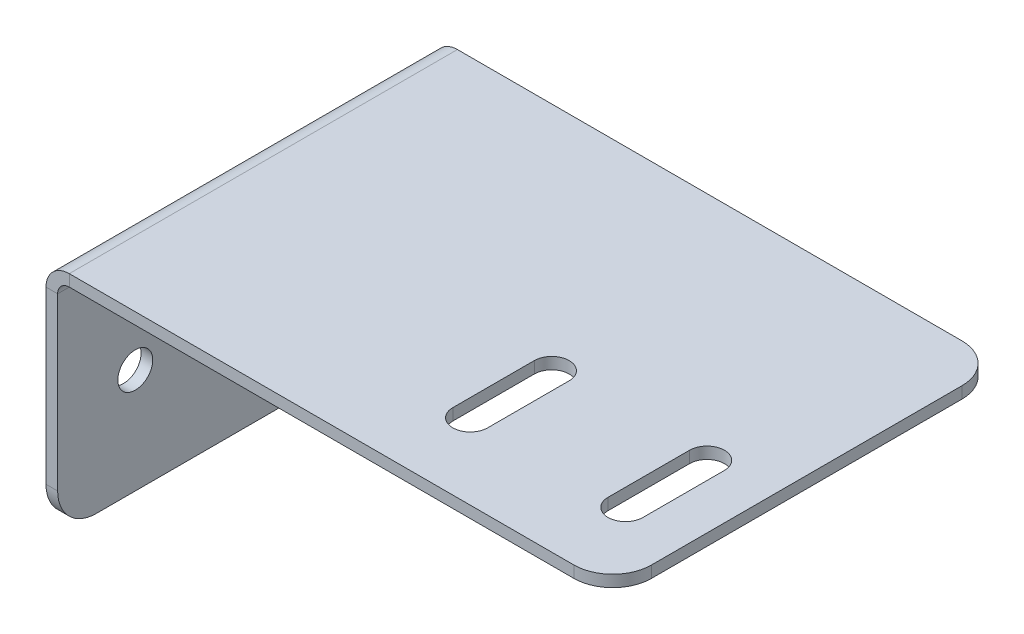
ISO-10303-21;
HEADER;
FILE_DESCRIPTION(('STEP AP214'),'2;1');
FILE_NAME('part.step','',(''),(''),'','','');
FILE_SCHEMA(('AUTOMOTIVE_DESIGN { 1 0 10303 214 1 1 1 1 }'));
ENDSEC;
DATA;
#1=APPLICATION_CONTEXT('core data for automotive mechanical design processes');
#2=APPLICATION_PROTOCOL_DEFINITION('international standard','automotive_design',2000,#1);
#3=PRODUCT_CONTEXT('',#1,'mechanical');
#4=PRODUCT('Part','Part','',(#3));
#5=PRODUCT_RELATED_PRODUCT_CATEGORY('part','',(#4));
#6=PRODUCT_DEFINITION_FORMATION('','',#4);
#7=PRODUCT_DEFINITION_CONTEXT('part definition',#1,'design');
#8=PRODUCT_DEFINITION('design','',#6,#7);
#9=PRODUCT_DEFINITION_SHAPE('','',#8);
#10=(LENGTH_UNIT() NAMED_UNIT(*) SI_UNIT(.MILLI.,.METRE.));
#11=(NAMED_UNIT(*) PLANE_ANGLE_UNIT() SI_UNIT($,.RADIAN.));
#12=(NAMED_UNIT(*) SI_UNIT($,.STERADIAN.) SOLID_ANGLE_UNIT());
#13=UNCERTAINTY_MEASURE_WITH_UNIT(LENGTH_MEASURE(1.E-05),#10,'distance_accuracy_value','');
#14=(GEOMETRIC_REPRESENTATION_CONTEXT(3) GLOBAL_UNCERTAINTY_ASSIGNED_CONTEXT((#13)) GLOBAL_UNIT_ASSIGNED_CONTEXT((#10,
#11,#12)) REPRESENTATION_CONTEXT('',''));
#15=CARTESIAN_POINT('',(0.,0.,0.));
#16=DIRECTION('',(0.,0.,1.));
#17=DIRECTION('',(1.,0.,0.));
#18=AXIS2_PLACEMENT_3D('',#15,#16,#17);
#19=CARTESIAN_POINT('',(73.,0.,50.));
#20=DIRECTION('',(0.,-1.,0.));
#21=DIRECTION('',(1.,0.,0.));
#22=AXIS2_PLACEMENT_3D('',#19,#20,#21);
#23=PLANE('',#22);
#24=DIRECTION('',(-1.,0.,0.));
#25=VECTOR('',#24,1.);
#26=CARTESIAN_POINT('',(73.,0.,50.));
#27=LINE('',#26,#25);
#28=CARTESIAN_POINT('',(68.,0.,50.));
#29=VERTEX_POINT('',#28);
#30=CARTESIAN_POINT('',(3.,0.,50.));
#31=VERTEX_POINT('',#30);
#32=EDGE_CURVE('E437',#29,#31,#27,.T.);
#33=ORIENTED_EDGE('',*,*,#32,.F.);
#34=CARTESIAN_POINT('',(68.,0.,45.));
#35=DIRECTION('',(0.,-1.,0.));
#36=DIRECTION('',(1.,0.,0.));
#37=AXIS2_PLACEMENT_3D('',#34,#35,#36);
#38=CIRCLE('',#37,5.);
#39=CARTESIAN_POINT('',(73.,0.,45.));
#40=VERTEX_POINT('',#39);
#41=EDGE_CURVE('E526',#29,#40,#38,.F.);
#42=ORIENTED_EDGE('',*,*,#41,.T.);
#43=DIRECTION('',(0.,0.,-1.));
#44=VECTOR('',#43,1.);
#45=CARTESIAN_POINT('',(73.,0.,50.));
#46=LINE('',#45,#44);
#47=CARTESIAN_POINT('',(73.,0.,5.));
#48=VERTEX_POINT('',#47);
#49=EDGE_CURVE('E471',#40,#48,#46,.T.);
#50=ORIENTED_EDGE('',*,*,#49,.T.);
#51=CARTESIAN_POINT('',(68.,0.,5.));
#52=DIRECTION('',(0.,-1.,0.));
#53=DIRECTION('',(1.,0.,0.));
#54=AXIS2_PLACEMENT_3D('',#51,#52,#53);
#55=CIRCLE('',#54,5.);
#56=CARTESIAN_POINT('',(68.,0.,0.));
#57=VERTEX_POINT('',#56);
#58=EDGE_CURVE('E523',#48,#57,#55,.F.);
#59=ORIENTED_EDGE('',*,*,#58,.T.);
#60=DIRECTION('',(-1.,0.,0.));
#61=VECTOR('',#60,1.);
#62=CARTESIAN_POINT('',(73.,0.,0.));
#63=LINE('',#62,#61);
#64=CARTESIAN_POINT('',(3.,0.,0.));
#65=VERTEX_POINT('',#64);
#66=EDGE_CURVE('E458',#57,#65,#63,.T.);
#67=ORIENTED_EDGE('',*,*,#66,.T.);
#68=DIRECTION('',(0.,0.,-1.));
#69=VECTOR('',#68,1.);
#70=CARTESIAN_POINT('',(3.,0.,50.));
#71=LINE('',#70,#69);
#72=EDGE_CURVE('E467',#31,#65,#71,.T.);
#73=ORIENTED_EDGE('',*,*,#72,.F.);
#74=EDGE_LOOP('',(#33,#42,#50,#59,#67,#73));
#75=FACE_BOUND('',#74,.T.);
#76=CARTESIAN_POINT('',(44.9000000000001,0.,29.75));
#77=DIRECTION('',(0.,1.,0.));
#78=DIRECTION('',(0.,0.,1.));
#79=AXIS2_PLACEMENT_3D('',#76,#77,#78);
#80=CIRCLE('',#79,2.25);
#81=CARTESIAN_POINT('',(47.1500000000001,0.,29.75));
#82=VERTEX_POINT('',#81);
#83=CARTESIAN_POINT('',(42.6500000000001,0.,29.75));
#84=VERTEX_POINT('',#83);
#85=EDGE_CURVE('E403',#82,#84,#80,.T.);
#86=ORIENTED_EDGE('',*,*,#85,.F.);
#87=DIRECTION('',(0.,0.,-1.));
#88=VECTOR('',#87,1.);
#89=CARTESIAN_POINT('',(47.1500000000001,0.,40.25));
#90=LINE('',#89,#88);
#91=CARTESIAN_POINT('',(47.1500000000001,0.,40.25));
#92=VERTEX_POINT('',#91);
#93=EDGE_CURVE('E382',#92,#82,#90,.T.);
#94=ORIENTED_EDGE('',*,*,#93,.F.);
#95=CARTESIAN_POINT('',(44.9000000000001,0.,40.25));
#96=DIRECTION('',(0.,1.,0.));
#97=DIRECTION('',(0.,0.,1.));
#98=AXIS2_PLACEMENT_3D('',#95,#96,#97);
#99=CIRCLE('',#98,2.25);
#100=CARTESIAN_POINT('',(42.6500000000002,0.,40.25));
#101=VERTEX_POINT('',#100);
#102=EDGE_CURVE('E393',#101,#92,#99,.T.);
#103=ORIENTED_EDGE('',*,*,#102,.F.);
#104=DIRECTION('',(0.,0.,-1.));
#105=VECTOR('',#104,1.);
#106=CARTESIAN_POINT('',(42.6500000000001,0.,40.25));
#107=LINE('',#106,#105);
#108=EDGE_CURVE('E385',#101,#84,#107,.T.);
#109=ORIENTED_EDGE('',*,*,#108,.T.);
#110=EDGE_LOOP('',(#86,#94,#103,#109));
#111=FACE_BOUND('',#110,.T.);
#112=CARTESIAN_POINT('',(64.9000000000001,0.,29.75));
#113=DIRECTION('',(0.,1.,0.));
#114=DIRECTION('',(0.,0.,1.));
#115=AXIS2_PLACEMENT_3D('',#112,#113,#114);
#116=CIRCLE('',#115,2.25);
#117=CARTESIAN_POINT('',(67.1500000000001,0.,29.75));
#118=VERTEX_POINT('',#117);
#119=CARTESIAN_POINT('',(62.6500000000001,0.,29.75));
#120=VERTEX_POINT('',#119);
#121=EDGE_CURVE('E338',#118,#120,#116,.T.);
#122=ORIENTED_EDGE('',*,*,#121,.F.);
#123=DIRECTION('',(0.,0.,-1.));
#124=VECTOR('',#123,1.);
#125=CARTESIAN_POINT('',(67.1500000000001,0.,40.25));
#126=LINE('',#125,#124);
#127=CARTESIAN_POINT('',(67.1500000000001,0.,40.25));
#128=VERTEX_POINT('',#127);
#129=EDGE_CURVE('E352',#128,#118,#126,.T.);
#130=ORIENTED_EDGE('',*,*,#129,.F.);
#131=CARTESIAN_POINT('',(64.9000000000001,0.,40.25));
#132=DIRECTION('',(0.,1.,0.));
#133=DIRECTION('',(0.,0.,1.));
#134=AXIS2_PLACEMENT_3D('',#131,#132,#133);
#135=CIRCLE('',#134,2.25);
#136=CARTESIAN_POINT('',(62.6500000000001,0.,40.25));
#137=VERTEX_POINT('',#136);
#138=EDGE_CURVE('E349',#137,#128,#135,.T.);
#139=ORIENTED_EDGE('',*,*,#138,.F.);
#140=DIRECTION('',(0.,0.,-1.));
#141=VECTOR('',#140,1.);
#142=CARTESIAN_POINT('',(62.6500000000001,0.,40.25));
#143=LINE('',#142,#141);
#144=EDGE_CURVE('E330',#137,#120,#143,.T.);
#145=ORIENTED_EDGE('',*,*,#144,.T.);
#146=EDGE_LOOP('',(#122,#130,#139,#145));
#147=FACE_BOUND('',#146,.T.);
#148=ADVANCED_FACE('F186',(#75,#111,#147),#23,.F.);
#149=CARTESIAN_POINT('',(3.,0.,50.));
#150=DIRECTION('',(0.,0.,1.));
#151=DIRECTION('',(1.,0.,0.));
#152=AXIS2_PLACEMENT_3D('',#149,#150,#151);
#153=PLANE('',#152);
#154=DIRECTION('',(0.,-1.,0.));
#155=VECTOR('',#154,1.);
#156=CARTESIAN_POINT('',(3.,0.,50.));
#157=LINE('',#156,#155);
#158=CARTESIAN_POINT('',(3.,-1.5,50.));
#159=VERTEX_POINT('',#158);
#160=EDGE_CURVE('E503',#31,#159,#157,.T.);
#161=ORIENTED_EDGE('',*,*,#160,.F.);
#162=CARTESIAN_POINT('',(3.,-3.,50.));
#163=DIRECTION('',(0.,0.,-1.));
#164=DIRECTION('',(-1.,0.,0.));
#165=AXIS2_PLACEMENT_3D('',#162,#163,#164);
#166=CIRCLE('',#165,3.);
#167=CARTESIAN_POINT('',(0.,-3.,50.));
#168=VERTEX_POINT('',#167);
#169=EDGE_CURVE('E440',#31,#168,#166,.F.);
#170=ORIENTED_EDGE('',*,*,#169,.T.);
#171=DIRECTION('',(-1.,0.,0.));
#172=VECTOR('',#171,1.);
#173=CARTESIAN_POINT('',(1.5,-3.,50.));
#174=LINE('',#173,#172);
#175=CARTESIAN_POINT('',(1.5,-3.,50.));
#176=VERTEX_POINT('',#175);
#177=EDGE_CURVE('E500',#176,#168,#174,.T.);
#178=ORIENTED_EDGE('',*,*,#177,.F.);
#179=CARTESIAN_POINT('',(3.,-3.,50.));
#180=DIRECTION('',(0.,0.,1.));
#181=DIRECTION('',(1.,0.,0.));
#182=AXIS2_PLACEMENT_3D('',#179,#180,#181);
#183=CIRCLE('',#182,1.5);
#184=EDGE_CURVE('E430',#159,#176,#183,.T.);
#185=ORIENTED_EDGE('',*,*,#184,.F.);
#186=EDGE_LOOP('',(#161,#170,#178,#185));
#187=FACE_BOUND('',#186,.T.);
#188=ADVANCED_FACE('F577',(#187),#153,.T.);
#189=CARTESIAN_POINT('',(1.5,-3.,50.));
#190=DIRECTION('',(0.,0.,1.));
#191=DIRECTION('',(1.,0.,0.));
#192=AXIS2_PLACEMENT_3D('',#189,#190,#191);
#193=PLANE('',#192);
#194=DIRECTION('',(-1.,0.,0.));
#195=VECTOR('',#194,1.);
#196=CARTESIAN_POINT('',(73.,-1.5,50.));
#197=LINE('',#196,#195);
#198=CARTESIAN_POINT('',(68.,-1.5,50.));
#199=VERTEX_POINT('',#198);
#200=EDGE_CURVE('E434',#199,#159,#197,.T.);
#201=ORIENTED_EDGE('',*,*,#200,.F.);
#202=DIRECTION('',(0.,-1.,0.));
#203=VECTOR('',#202,1.);
#204=CARTESIAN_POINT('',(68.,-3.,50.));
#205=LINE('',#204,#203);
#206=EDGE_CURVE('E520',#199,#29,#205,.F.);
#207=ORIENTED_EDGE('',*,*,#206,.T.);
#208=ORIENTED_EDGE('',*,*,#32,.T.);
#209=ORIENTED_EDGE('',*,*,#160,.T.);
#210=EDGE_LOOP('',(#201,#207,#208,#209));
#211=FACE_BOUND('',#210,.T.);
#212=ADVANCED_FACE('F596',(#211),#193,.T.);
#213=CARTESIAN_POINT('',(0.,-3.,0.));
#214=DIRECTION('',(0.,0.,-1.));
#215=DIRECTION('',(-1.,0.,0.));
#216=AXIS2_PLACEMENT_3D('',#213,#214,#215);
#217=PLANE('',#216);
#218=DIRECTION('',(1.,0.,0.));
#219=VECTOR('',#218,1.);
#220=CARTESIAN_POINT('',(0.,-3.,0.));
#221=LINE('',#220,#219);
#222=CARTESIAN_POINT('',(0.,-3.,0.));
#223=VERTEX_POINT('',#222);
#224=CARTESIAN_POINT('',(1.5,-3.,0.));
#225=VERTEX_POINT('',#224);
#226=EDGE_CURVE('E497',#223,#225,#221,.T.);
#227=ORIENTED_EDGE('',*,*,#226,.F.);
#228=CARTESIAN_POINT('',(3.,-3.,0.));
#229=DIRECTION('',(0.,0.,-1.));
#230=DIRECTION('',(-1.,0.,0.));
#231=AXIS2_PLACEMENT_3D('',#228,#229,#230);
#232=CIRCLE('',#231,3.);
#233=EDGE_CURVE('E427',#65,#223,#232,.F.);
#234=ORIENTED_EDGE('',*,*,#233,.F.);
#235=DIRECTION('',(0.,1.,0.));
#236=VECTOR('',#235,1.);
#237=CARTESIAN_POINT('',(3.,-1.5,0.));
#238=LINE('',#237,#236);
#239=CARTESIAN_POINT('',(3.,-1.5,0.));
#240=VERTEX_POINT('',#239);
#241=EDGE_CURVE('E493',#240,#65,#238,.T.);
#242=ORIENTED_EDGE('',*,*,#241,.F.);
#243=CARTESIAN_POINT('',(3.,-3.,0.));
#244=DIRECTION('',(0.,0.,1.));
#245=DIRECTION('',(1.,0.,0.));
#246=AXIS2_PLACEMENT_3D('',#243,#244,#245);
#247=CIRCLE('',#246,1.5);
#248=EDGE_CURVE('E452',#240,#225,#247,.T.);
#249=ORIENTED_EDGE('',*,*,#248,.T.);
#250=EDGE_LOOP('',(#227,#234,#242,#249));
#251=FACE_BOUND('',#250,.T.);
#252=ADVANCED_FACE('F584',(#251),#217,.T.);
#253=CARTESIAN_POINT('',(3.,-1.5,0.));
#254=DIRECTION('',(0.,0.,-1.));
#255=DIRECTION('',(-1.,0.,0.));
#256=AXIS2_PLACEMENT_3D('',#253,#254,#255);
#257=PLANE('',#256);
#258=DIRECTION('',(0.,-1.,0.));
#259=VECTOR('',#258,1.);
#260=CARTESIAN_POINT('',(1.5,0.,0.));
#261=LINE('',#260,#259);
#262=CARTESIAN_POINT('',(1.5,-25.,0.));
#263=VERTEX_POINT('',#262);
#264=EDGE_CURVE('E448',#225,#263,#261,.T.);
#265=ORIENTED_EDGE('',*,*,#264,.T.);
#266=DIRECTION('',(-1.,0.,0.));
#267=VECTOR('',#266,1.);
#268=CARTESIAN_POINT('',(3.,-25.,0.));
#269=LINE('',#268,#267);
#270=CARTESIAN_POINT('',(0.,-25.,0.));
#271=VERTEX_POINT('',#270);
#272=EDGE_CURVE('E533',#263,#271,#269,.T.);
#273=ORIENTED_EDGE('',*,*,#272,.T.);
#274=DIRECTION('',(0.,-1.,0.));
#275=VECTOR('',#274,1.);
#276=CARTESIAN_POINT('',(0.,0.,0.));
#277=LINE('',#276,#275);
#278=EDGE_CURVE('E422',#223,#271,#277,.T.);
#279=ORIENTED_EDGE('',*,*,#278,.F.);
#280=ORIENTED_EDGE('',*,*,#226,.T.);
#281=EDGE_LOOP('',(#265,#273,#279,#280));
#282=FACE_BOUND('',#281,.T.);
#283=ADVANCED_FACE('F560',(#282),#257,.T.);
#284=CARTESIAN_POINT('',(0.,0.,50.));
#285=DIRECTION('',(1.,0.,0.));
#286=DIRECTION('',(0.,1.,0.));
#287=AXIS2_PLACEMENT_3D('',#284,#285,#286);
#288=PLANE('',#287);
#289=CARTESIAN_POINT('',(0.,-16.5,40.));
#290=DIRECTION('',(1.,0.,0.));
#291=DIRECTION('',(0.,0.,-1.));
#292=AXIS2_PLACEMENT_3D('',#289,#290,#291);
#293=CIRCLE('',#292,2.25);
#294=CARTESIAN_POINT('',(0.,-16.5,37.75));
#295=VERTEX_POINT('',#294);
#296=EDGE_CURVE('E935',#295,#295,#293,.T.);
#297=ORIENTED_EDGE('',*,*,#296,.T.);
#298=EDGE_LOOP('',(#297));
#299=FACE_BOUND('',#298,.T.);
#300=CARTESIAN_POINT('',(0.,-16.5,9.99999999999999));
#301=DIRECTION('',(1.,0.,0.));
#302=DIRECTION('',(0.,0.,-1.));
#303=AXIS2_PLACEMENT_3D('',#300,#301,#302);
#304=CIRCLE('',#303,2.25);
#305=CARTESIAN_POINT('',(0.,-16.5,7.75));
#306=VERTEX_POINT('',#305);
#307=EDGE_CURVE('E360',#306,#306,#304,.T.);
#308=ORIENTED_EDGE('',*,*,#307,.T.);
#309=EDGE_LOOP('',(#308));
#310=FACE_BOUND('',#309,.T.);
#311=ORIENTED_EDGE('',*,*,#278,.T.);
#312=CARTESIAN_POINT('',(0.,-25.,5.));
#313=DIRECTION('',(1.,0.,0.));
#314=DIRECTION('',(0.,1.,0.));
#315=AXIS2_PLACEMENT_3D('',#312,#313,#314);
#316=CIRCLE('',#315,5.);
#317=CARTESIAN_POINT('',(0.,-30.,5.));
#318=VERTEX_POINT('',#317);
#319=EDGE_CURVE('E540',#271,#318,#316,.F.);
#320=ORIENTED_EDGE('',*,*,#319,.T.);
#321=DIRECTION('',(0.,0.,-1.));
#322=VECTOR('',#321,1.);
#323=CARTESIAN_POINT('',(0.,-30.,50.));
#324=LINE('',#323,#322);
#325=CARTESIAN_POINT('',(0.,-30.,45.));
#326=VERTEX_POINT('',#325);
#327=EDGE_CURVE('E490',#326,#318,#324,.T.);
#328=ORIENTED_EDGE('',*,*,#327,.F.);
#329=CARTESIAN_POINT('',(0.,-25.,45.));
#330=DIRECTION('',(1.,0.,0.));
#331=DIRECTION('',(0.,1.,0.));
#332=AXIS2_PLACEMENT_3D('',#329,#330,#331);
#333=CIRCLE('',#332,5.);
#334=CARTESIAN_POINT('',(0.,-25.,50.));
#335=VERTEX_POINT('',#334);
#336=EDGE_CURVE('E537',#326,#335,#333,.F.);
#337=ORIENTED_EDGE('',*,*,#336,.T.);
#338=DIRECTION('',(0.,-1.,0.));
#339=VECTOR('',#338,1.);
#340=CARTESIAN_POINT('',(0.,0.,50.));
#341=LINE('',#340,#339);
#342=EDGE_CURVE('E423',#168,#335,#341,.T.);
#343=ORIENTED_EDGE('',*,*,#342,.F.);
#344=DIRECTION('',(0.,0.,-1.));
#345=VECTOR('',#344,1.);
#346=CARTESIAN_POINT('',(0.,-3.,50.));
#347=LINE('',#346,#345);
#348=EDGE_CURVE('E444',#168,#223,#347,.T.);
#349=ORIENTED_EDGE('',*,*,#348,.T.);
#350=EDGE_LOOP('',(#311,#320,#328,#337,#343,#349));
#351=FACE_BOUND('',#350,.T.);
#352=ADVANCED_FACE('F565',(#299,#310,#351),#288,.F.);
#353=CARTESIAN_POINT('',(1.5,-30.,50.));
#354=DIRECTION('',(0.,-1.,0.));
#355=DIRECTION('',(0.,0.,-1.));
#356=AXIS2_PLACEMENT_3D('',#353,#354,#355);
#357=PLANE('',#356);
#358=ORIENTED_EDGE('',*,*,#327,.T.);
#359=DIRECTION('',(-1.,0.,0.));
#360=VECTOR('',#359,1.);
#361=CARTESIAN_POINT('',(1.5,-30.,5.));
#362=LINE('',#361,#360);
#363=CARTESIAN_POINT('',(1.5,-30.,5.));
#364=VERTEX_POINT('',#363);
#365=EDGE_CURVE('E208',#318,#364,#362,.F.);
#366=ORIENTED_EDGE('',*,*,#365,.T.);
#367=DIRECTION('',(0.,0.,-1.));
#368=VECTOR('',#367,1.);
#369=CARTESIAN_POINT('',(1.5,-30.,50.));
#370=LINE('',#369,#368);
#371=CARTESIAN_POINT('',(1.5,-30.,45.));
#372=VERTEX_POINT('',#371);
#373=EDGE_CURVE('E487',#372,#364,#370,.T.);
#374=ORIENTED_EDGE('',*,*,#373,.F.);
#375=DIRECTION('',(-1.,0.,0.));
#376=VECTOR('',#375,1.);
#377=CARTESIAN_POINT('',(1.5,-30.,45.));
#378=LINE('',#377,#376);
#379=EDGE_CURVE('E543',#372,#326,#378,.T.);
#380=ORIENTED_EDGE('',*,*,#379,.T.);
#381=EDGE_LOOP('',(#358,#366,#374,#380));
#382=FACE_BOUND('',#381,.T.);
#383=ADVANCED_FACE('F566',(#382),#357,.T.);
#384=CARTESIAN_POINT('',(1.5,0.,50.));
#385=DIRECTION('',(1.,0.,0.));
#386=DIRECTION('',(0.,1.,0.));
#387=AXIS2_PLACEMENT_3D('',#384,#385,#386);
#388=PLANE('',#387);
#389=CARTESIAN_POINT('',(1.5,-16.5,40.));
#390=DIRECTION('',(1.,0.,0.));
#391=DIRECTION('',(0.,0.,-1.));
#392=AXIS2_PLACEMENT_3D('',#389,#390,#391);
#393=CIRCLE('',#392,2.24999999999999);
#394=CARTESIAN_POINT('',(1.5,-16.5,37.75));
#395=VERTEX_POINT('',#394);
#396=EDGE_CURVE('E940',#395,#395,#393,.T.);
#397=ORIENTED_EDGE('',*,*,#396,.F.);
#398=EDGE_LOOP('',(#397));
#399=FACE_BOUND('',#398,.T.);
#400=CARTESIAN_POINT('',(1.5,-16.5,9.99999999999999));
#401=DIRECTION('',(1.,0.,0.));
#402=DIRECTION('',(0.,0.,-1.));
#403=AXIS2_PLACEMENT_3D('',#400,#401,#402);
#404=CIRCLE('',#403,2.24999999999999);
#405=CARTESIAN_POINT('',(1.5,-16.5,7.75000000000001));
#406=VERTEX_POINT('',#405);
#407=EDGE_CURVE('E932',#406,#406,#404,.T.);
#408=ORIENTED_EDGE('',*,*,#407,.F.);
#409=EDGE_LOOP('',(#408));
#410=FACE_BOUND('',#409,.T.);
#411=ORIENTED_EDGE('',*,*,#373,.T.);
#412=CARTESIAN_POINT('',(1.5,-25.,5.));
#413=DIRECTION('',(1.,0.,0.));
#414=DIRECTION('',(0.,1.,0.));
#415=AXIS2_PLACEMENT_3D('',#412,#413,#414);
#416=CIRCLE('',#415,5.);
#417=EDGE_CURVE('E195',#364,#263,#416,.T.);
#418=ORIENTED_EDGE('',*,*,#417,.T.);
#419=ORIENTED_EDGE('',*,*,#264,.F.);
#420=DIRECTION('',(0.,0.,-1.));
#421=VECTOR('',#420,1.);
#422=CARTESIAN_POINT('',(1.5,-3.,50.));
#423=LINE('',#422,#421);
#424=EDGE_CURVE('E483',#176,#225,#423,.T.);
#425=ORIENTED_EDGE('',*,*,#424,.F.);
#426=DIRECTION('',(0.,-1.,0.));
#427=VECTOR('',#426,1.);
#428=CARTESIAN_POINT('',(1.5,0.,50.));
#429=LINE('',#428,#427);
#430=CARTESIAN_POINT('',(1.5,-25.,50.));
#431=VERTEX_POINT('',#430);
#432=EDGE_CURVE('E426',#176,#431,#429,.T.);
#433=ORIENTED_EDGE('',*,*,#432,.T.);
#434=CARTESIAN_POINT('',(1.5,-25.,45.));
#435=DIRECTION('',(1.,0.,0.));
#436=DIRECTION('',(0.,1.,0.));
#437=AXIS2_PLACEMENT_3D('',#434,#435,#436);
#438=CIRCLE('',#437,5.);
#439=EDGE_CURVE('E549',#431,#372,#438,.T.);
#440=ORIENTED_EDGE('',*,*,#439,.T.);
#441=EDGE_LOOP('',(#411,#418,#419,#425,#433,#440));
#442=FACE_BOUND('',#441,.T.);
#443=ADVANCED_FACE('F555',(#399,#410,#442),#388,.T.);
#444=CARTESIAN_POINT('',(3.,-3.,50.));
#445=DIRECTION('',(0.,0.,-1.));
#446=DIRECTION('',(-1.,0.,0.));
#447=AXIS2_PLACEMENT_3D('',#444,#445,#446);
#448=CYLINDRICAL_SURFACE('',#447,1.5);
#449=ORIENTED_EDGE('',*,*,#248,.F.);
#450=DIRECTION('',(0.,0.,-1.));
#451=VECTOR('',#450,1.);
#452=CARTESIAN_POINT('',(3.,-1.5,50.));
#453=LINE('',#452,#451);
#454=EDGE_CURVE('E479',#159,#240,#453,.T.);
#455=ORIENTED_EDGE('',*,*,#454,.F.);
#456=ORIENTED_EDGE('',*,*,#184,.T.);
#457=ORIENTED_EDGE('',*,*,#424,.T.);
#458=EDGE_LOOP('',(#449,#455,#456,#457));
#459=FACE_BOUND('',#458,.T.);
#460=ADVANCED_FACE('F588',(#459),#448,.F.);
#461=CARTESIAN_POINT('',(73.,-1.5,50.));
#462=DIRECTION('',(0.,-1.,0.));
#463=DIRECTION('',(1.,0.,0.));
#464=AXIS2_PLACEMENT_3D('',#461,#462,#463);
#465=PLANE('',#464);
#466=DIRECTION('',(0.,0.,1.));
#467=VECTOR('',#466,1.);
#468=CARTESIAN_POINT('',(67.1500000000001,-1.5,50.));
#469=LINE('',#468,#467);
#470=CARTESIAN_POINT('',(67.1500000000001,-1.5,29.75));
#471=VERTEX_POINT('',#470);
#472=CARTESIAN_POINT('',(67.1500000000001,-1.5,40.25));
#473=VERTEX_POINT('',#472);
#474=EDGE_CURVE('E374',#471,#473,#469,.T.);
#475=ORIENTED_EDGE('',*,*,#474,.F.);
#476=CARTESIAN_POINT('',(64.9000000000001,-1.5,29.75));
#477=DIRECTION('',(0.,-1.,0.));
#478=DIRECTION('',(1.,0.,0.));
#479=AXIS2_PLACEMENT_3D('',#476,#477,#478);
#480=CIRCLE('',#479,2.25);
#481=CARTESIAN_POINT('',(62.6500000000001,-1.5,29.75));
#482=VERTEX_POINT('',#481);
#483=EDGE_CURVE('E379',#482,#471,#480,.T.);
#484=ORIENTED_EDGE('',*,*,#483,.F.);
#485=DIRECTION('',(0.,0.,-1.));
#486=VECTOR('',#485,1.);
#487=CARTESIAN_POINT('',(62.6500000000001,-1.5,50.));
#488=LINE('',#487,#486);
#489=CARTESIAN_POINT('',(62.6500000000001,-1.5,40.25));
#490=VERTEX_POINT('',#489);
#491=EDGE_CURVE('E333',#490,#482,#488,.T.);
#492=ORIENTED_EDGE('',*,*,#491,.F.);
#493=CARTESIAN_POINT('',(64.9000000000001,-1.5,40.25));
#494=DIRECTION('',(0.,-1.,0.));
#495=DIRECTION('',(1.,0.,0.));
#496=AXIS2_PLACEMENT_3D('',#493,#494,#495);
#497=CIRCLE('',#496,2.25);
#498=EDGE_CURVE('E337',#473,#490,#497,.T.);
#499=ORIENTED_EDGE('',*,*,#498,.F.);
#500=EDGE_LOOP('',(#475,#484,#492,#499));
#501=FACE_BOUND('',#500,.T.);
#502=DIRECTION('',(0.,0.,-1.));
#503=VECTOR('',#502,1.);
#504=CARTESIAN_POINT('',(42.6500000000001,-1.5,50.));
#505=LINE('',#504,#503);
#506=CARTESIAN_POINT('',(42.6500000000001,-1.5,40.25));
#507=VERTEX_POINT('',#506);
#508=CARTESIAN_POINT('',(42.6500000000001,-1.5,29.75));
#509=VERTEX_POINT('',#508);
#510=EDGE_CURVE('E412',#507,#509,#505,.T.);
#511=ORIENTED_EDGE('',*,*,#510,.F.);
#512=CARTESIAN_POINT('',(44.9000000000001,-1.5,40.25));
#513=DIRECTION('',(0.,-1.,0.));
#514=DIRECTION('',(1.,0.,0.));
#515=AXIS2_PLACEMENT_3D('',#512,#513,#514);
#516=CIRCLE('',#515,2.25);
#517=CARTESIAN_POINT('',(47.1500000000001,-1.5,40.25));
#518=VERTEX_POINT('',#517);
#519=EDGE_CURVE('E409',#518,#507,#516,.T.);
#520=ORIENTED_EDGE('',*,*,#519,.F.);
#521=DIRECTION('',(0.,0.,1.));
#522=VECTOR('',#521,1.);
#523=CARTESIAN_POINT('',(47.1500000000001,-1.5,50.));
#524=LINE('',#523,#522);
#525=CARTESIAN_POINT('',(47.1500000000001,-1.5,29.75));
#526=VERTEX_POINT('',#525);
#527=EDGE_CURVE('E419',#526,#518,#524,.T.);
#528=ORIENTED_EDGE('',*,*,#527,.F.);
#529=CARTESIAN_POINT('',(44.9000000000001,-1.5,29.75));
#530=DIRECTION('',(0.,-1.,0.));
#531=DIRECTION('',(1.,0.,0.));
#532=AXIS2_PLACEMENT_3D('',#529,#530,#531);
#533=CIRCLE('',#532,2.25);
#534=EDGE_CURVE('E415',#509,#526,#533,.T.);
#535=ORIENTED_EDGE('',*,*,#534,.F.);
#536=EDGE_LOOP('',(#511,#520,#528,#535));
#537=FACE_BOUND('',#536,.T.);
#538=DIRECTION('',(0.,0.,-1.));
#539=VECTOR('',#538,1.);
#540=CARTESIAN_POINT('',(73.,-1.5,50.));
#541=LINE('',#540,#539);
#542=CARTESIAN_POINT('',(73.,-1.5,45.));
#543=VERTEX_POINT('',#542);
#544=CARTESIAN_POINT('',(73.,-1.5,5.));
#545=VERTEX_POINT('',#544);
#546=EDGE_CURVE('E475',#543,#545,#541,.T.);
#547=ORIENTED_EDGE('',*,*,#546,.F.);
#548=CARTESIAN_POINT('',(68.,-1.5,45.));
#549=DIRECTION('',(0.,-1.,0.));
#550=DIRECTION('',(1.,0.,0.));
#551=AXIS2_PLACEMENT_3D('',#548,#549,#550);
#552=CIRCLE('',#551,5.);
#553=EDGE_CURVE('E517',#543,#199,#552,.T.);
#554=ORIENTED_EDGE('',*,*,#553,.T.);
#555=ORIENTED_EDGE('',*,*,#200,.T.);
#556=ORIENTED_EDGE('',*,*,#454,.T.);
#557=DIRECTION('',(-1.,0.,0.));
#558=VECTOR('',#557,1.);
#559=CARTESIAN_POINT('',(73.,-1.5,0.));
#560=LINE('',#559,#558);
#561=CARTESIAN_POINT('',(68.,-1.5,0.));
#562=VERTEX_POINT('',#561);
#563=EDGE_CURVE('E455',#562,#240,#560,.T.);
#564=ORIENTED_EDGE('',*,*,#563,.F.);
#565=CARTESIAN_POINT('',(68.,-1.5,5.));
#566=DIRECTION('',(0.,-1.,0.));
#567=DIRECTION('',(1.,0.,0.));
#568=AXIS2_PLACEMENT_3D('',#565,#566,#567);
#569=CIRCLE('',#568,5.);
#570=EDGE_CURVE('E514',#562,#545,#569,.T.);
#571=ORIENTED_EDGE('',*,*,#570,.T.);
#572=EDGE_LOOP('',(#547,#554,#555,#556,#564,#571));
#573=FACE_BOUND('',#572,.T.);
#574=ADVANCED_FACE('F592',(#501,#537,#573),#465,.T.);
#575=CARTESIAN_POINT('',(73.,0.,50.));
#576=DIRECTION('',(1.,0.,0.));
#577=DIRECTION('',(0.,0.,-1.));
#578=AXIS2_PLACEMENT_3D('',#575,#576,#577);
#579=PLANE('',#578);
#580=ORIENTED_EDGE('',*,*,#49,.F.);
#581=DIRECTION('',(0.,-1.,0.));
#582=VECTOR('',#581,1.);
#583=CARTESIAN_POINT('',(73.,0.,45.));
#584=LINE('',#583,#582);
#585=EDGE_CURVE('E510',#40,#543,#584,.T.);
#586=ORIENTED_EDGE('',*,*,#585,.T.);
#587=ORIENTED_EDGE('',*,*,#546,.T.);
#588=DIRECTION('',(0.,-1.,0.));
#589=VECTOR('',#588,1.);
#590=CARTESIAN_POINT('',(73.,0.,5.));
#591=LINE('',#590,#589);
#592=EDGE_CURVE('E507',#545,#48,#591,.F.);
#593=ORIENTED_EDGE('',*,*,#592,.T.);
#594=EDGE_LOOP('',(#580,#586,#587,#593));
#595=FACE_BOUND('',#594,.T.);
#596=ADVANCED_FACE('F606',(#595),#579,.T.);
#597=CARTESIAN_POINT('',(3.,-3.,50.));
#598=DIRECTION('',(0.,0.,-1.));
#599=DIRECTION('',(-1.,0.,0.));
#600=AXIS2_PLACEMENT_3D('',#597,#598,#599);
#601=CYLINDRICAL_SURFACE('',#600,3.);
#602=ORIENTED_EDGE('',*,*,#233,.T.);
#603=ORIENTED_EDGE('',*,*,#348,.F.);
#604=ORIENTED_EDGE('',*,*,#169,.F.);
#605=ORIENTED_EDGE('',*,*,#72,.T.);
#606=EDGE_LOOP('',(#602,#603,#604,#605));
#607=FACE_BOUND('',#606,.T.);
#608=ADVANCED_FACE('F580',(#607),#601,.T.);
#609=CARTESIAN_POINT('',(3.,-3.,50.));
#610=DIRECTION('',(0.,0.,1.));
#611=DIRECTION('',(1.,0.,0.));
#612=AXIS2_PLACEMENT_3D('',#609,#610,#611);
#613=PLANE('',#612);
#614=ORIENTED_EDGE('',*,*,#342,.T.);
#615=DIRECTION('',(-1.,0.,0.));
#616=VECTOR('',#615,1.);
#617=CARTESIAN_POINT('',(3.,-25.,50.));
#618=LINE('',#617,#616);
#619=EDGE_CURVE('E13',#335,#431,#618,.F.);
#620=ORIENTED_EDGE('',*,*,#619,.T.);
#621=ORIENTED_EDGE('',*,*,#432,.F.);
#622=ORIENTED_EDGE('',*,*,#177,.T.);
#623=EDGE_LOOP('',(#614,#620,#621,#622));
#624=FACE_BOUND('',#623,.T.);
#625=ADVANCED_FACE('F571',(#624),#613,.T.);
#626=CARTESIAN_POINT('',(3.,-3.,0.));
#627=DIRECTION('',(0.,0.,1.));
#628=DIRECTION('',(1.,0.,0.));
#629=AXIS2_PLACEMENT_3D('',#626,#627,#628);
#630=PLANE('',#629);
#631=ORIENTED_EDGE('',*,*,#66,.F.);
#632=DIRECTION('',(0.,-1.,0.));
#633=VECTOR('',#632,1.);
#634=CARTESIAN_POINT('',(68.,-1.5,0.));
#635=LINE('',#634,#633);
#636=EDGE_CURVE('E529',#57,#562,#635,.T.);
#637=ORIENTED_EDGE('',*,*,#636,.T.);
#638=ORIENTED_EDGE('',*,*,#563,.T.);
#639=ORIENTED_EDGE('',*,*,#241,.T.);
#640=EDGE_LOOP('',(#631,#637,#638,#639));
#641=FACE_BOUND('',#640,.T.);
#642=ADVANCED_FACE('F614',(#641),#630,.F.);
#643=CARTESIAN_POINT('',(44.9000000000001,0.,29.75));
#644=DIRECTION('',(0.,1.,0.));
#645=DIRECTION('',(0.,0.,1.));
#646=AXIS2_PLACEMENT_3D('',#643,#644,#645);
#647=CYLINDRICAL_SURFACE('',#646,2.25);
#648=ORIENTED_EDGE('',*,*,#534,.T.);
#649=DIRECTION('',(0.,-1.,0.));
#650=VECTOR('',#649,1.);
#651=CARTESIAN_POINT('',(47.1500000000001,-30.,29.75));
#652=LINE('',#651,#650);
#653=EDGE_CURVE('E400',#82,#526,#652,.T.);
#654=ORIENTED_EDGE('',*,*,#653,.F.);
#655=ORIENTED_EDGE('',*,*,#85,.T.);
#656=DIRECTION('',(0.,1.,0.));
#657=VECTOR('',#656,1.);
#658=CARTESIAN_POINT('',(42.6500000000001,0.,29.75));
#659=LINE('',#658,#657);
#660=EDGE_CURVE('E406',#509,#84,#659,.T.);
#661=ORIENTED_EDGE('',*,*,#660,.F.);
#662=EDGE_LOOP('',(#648,#654,#655,#661));
#663=FACE_BOUND('',#662,.T.);
#664=ADVANCED_FACE('F616',(#663),#647,.F.);
#665=CARTESIAN_POINT('',(44.9000000000001,0.,40.25));
#666=DIRECTION('',(0.,1.,0.));
#667=DIRECTION('',(0.,0.,1.));
#668=AXIS2_PLACEMENT_3D('',#665,#666,#667);
#669=CYLINDRICAL_SURFACE('',#668,2.25);
#670=ORIENTED_EDGE('',*,*,#519,.T.);
#671=DIRECTION('',(0.,1.,0.));
#672=VECTOR('',#671,1.);
#673=CARTESIAN_POINT('',(42.6500000000001,0.,40.25));
#674=LINE('',#673,#672);
#675=EDGE_CURVE('E396',#101,#507,#674,.F.);
#676=ORIENTED_EDGE('',*,*,#675,.F.);
#677=ORIENTED_EDGE('',*,*,#102,.T.);
#678=DIRECTION('',(0.,-1.,0.));
#679=VECTOR('',#678,1.);
#680=CARTESIAN_POINT('',(47.1500000000001,-30.,40.25));
#681=LINE('',#680,#679);
#682=EDGE_CURVE('E389',#92,#518,#681,.T.);
#683=ORIENTED_EDGE('',*,*,#682,.T.);
#684=EDGE_LOOP('',(#670,#676,#677,#683));
#685=FACE_BOUND('',#684,.T.);
#686=ADVANCED_FACE('F622',(#685),#669,.F.);
#687=CARTESIAN_POINT('',(42.6500000000001,0.,40.25));
#688=DIRECTION('',(-1.,0.,0.));
#689=DIRECTION('',(0.,0.,1.));
#690=AXIS2_PLACEMENT_3D('',#687,#688,#689);
#691=PLANE('',#690);
#692=ORIENTED_EDGE('',*,*,#510,.T.);
#693=ORIENTED_EDGE('',*,*,#660,.T.);
#694=ORIENTED_EDGE('',*,*,#108,.F.);
#695=ORIENTED_EDGE('',*,*,#675,.T.);
#696=EDGE_LOOP('',(#692,#693,#694,#695));
#697=FACE_BOUND('',#696,.T.);
#698=ADVANCED_FACE('F737',(#697),#691,.F.);
#699=CARTESIAN_POINT('',(47.1500000000001,-30.,40.25));
#700=DIRECTION('',(1.,0.,0.));
#701=DIRECTION('',(0.,1.,0.));
#702=AXIS2_PLACEMENT_3D('',#699,#700,#701);
#703=PLANE('',#702);
#704=ORIENTED_EDGE('',*,*,#527,.T.);
#705=ORIENTED_EDGE('',*,*,#682,.F.);
#706=ORIENTED_EDGE('',*,*,#93,.T.);
#707=ORIENTED_EDGE('',*,*,#653,.T.);
#708=EDGE_LOOP('',(#704,#705,#706,#707));
#709=FACE_BOUND('',#708,.T.);
#710=ADVANCED_FACE('F729',(#709),#703,.F.);
#711=CARTESIAN_POINT('',(64.9000000000001,0.,29.75));
#712=DIRECTION('',(0.,1.,0.));
#713=DIRECTION('',(0.,0.,1.));
#714=AXIS2_PLACEMENT_3D('',#711,#712,#713);
#715=CYLINDRICAL_SURFACE('',#714,2.25);
#716=ORIENTED_EDGE('',*,*,#483,.T.);
#717=DIRECTION('',(0.,-1.,0.));
#718=VECTOR('',#717,1.);
#719=CARTESIAN_POINT('',(67.1500000000001,-30.,29.75));
#720=LINE('',#719,#718);
#721=EDGE_CURVE('E344',#118,#471,#720,.T.);
#722=ORIENTED_EDGE('',*,*,#721,.F.);
#723=ORIENTED_EDGE('',*,*,#121,.T.);
#724=DIRECTION('',(0.,1.,0.));
#725=VECTOR('',#724,1.);
#726=CARTESIAN_POINT('',(62.6500000000001,0.,29.75));
#727=LINE('',#726,#725);
#728=EDGE_CURVE('E326',#482,#120,#727,.T.);
#729=ORIENTED_EDGE('',*,*,#728,.F.);
#730=EDGE_LOOP('',(#716,#722,#723,#729));
#731=FACE_BOUND('',#730,.T.);
#732=ADVANCED_FACE('F342',(#731),#715,.F.);
#733=CARTESIAN_POINT('',(64.9000000000001,0.,40.25));
#734=DIRECTION('',(0.,1.,0.));
#735=DIRECTION('',(0.,0.,1.));
#736=AXIS2_PLACEMENT_3D('',#733,#734,#735);
#737=CYLINDRICAL_SURFACE('',#736,2.25);
#738=ORIENTED_EDGE('',*,*,#498,.T.);
#739=DIRECTION('',(0.,1.,0.));
#740=VECTOR('',#739,1.);
#741=CARTESIAN_POINT('',(62.6500000000001,0.,40.25));
#742=LINE('',#741,#740);
#743=EDGE_CURVE('E366',#137,#490,#742,.F.);
#744=ORIENTED_EDGE('',*,*,#743,.F.);
#745=ORIENTED_EDGE('',*,*,#138,.T.);
#746=DIRECTION('',(0.,-1.,0.));
#747=VECTOR('',#746,1.);
#748=CARTESIAN_POINT('',(67.1500000000001,-30.,40.25));
#749=LINE('',#748,#747);
#750=EDGE_CURVE('E351',#128,#473,#749,.T.);
#751=ORIENTED_EDGE('',*,*,#750,.T.);
#752=EDGE_LOOP('',(#738,#744,#745,#751));
#753=FACE_BOUND('',#752,.T.);
#754=ADVANCED_FACE('F713',(#753),#737,.F.);
#755=CARTESIAN_POINT('',(62.6500000000001,0.,40.25));
#756=DIRECTION('',(-1.,0.,0.));
#757=DIRECTION('',(0.,0.,1.));
#758=AXIS2_PLACEMENT_3D('',#755,#756,#757);
#759=PLANE('',#758);
#760=ORIENTED_EDGE('',*,*,#491,.T.);
#761=ORIENTED_EDGE('',*,*,#728,.T.);
#762=ORIENTED_EDGE('',*,*,#144,.F.);
#763=ORIENTED_EDGE('',*,*,#743,.T.);
#764=EDGE_LOOP('',(#760,#761,#762,#763));
#765=FACE_BOUND('',#764,.T.);
#766=ADVANCED_FACE('F328',(#765),#759,.F.);
#767=CARTESIAN_POINT('',(67.1500000000001,-30.,40.25));
#768=DIRECTION('',(1.,0.,0.));
#769=DIRECTION('',(0.,1.,0.));
#770=AXIS2_PLACEMENT_3D('',#767,#768,#769);
#771=PLANE('',#770);
#772=ORIENTED_EDGE('',*,*,#474,.T.);
#773=ORIENTED_EDGE('',*,*,#750,.F.);
#774=ORIENTED_EDGE('',*,*,#129,.T.);
#775=ORIENTED_EDGE('',*,*,#721,.T.);
#776=EDGE_LOOP('',(#772,#773,#774,#775));
#777=FACE_BOUND('',#776,.T.);
#778=ADVANCED_FACE('F696',(#777),#771,.F.);
#779=CARTESIAN_POINT('',(1.5,-16.5,9.99999999999999));
#780=DIRECTION('',(1.,0.,0.));
#781=DIRECTION('',(0.,0.,-1.));
#782=AXIS2_PLACEMENT_3D('',#779,#780,#781);
#783=CYLINDRICAL_SURFACE('',#782,2.24999999999999);
#784=ORIENTED_EDGE('',*,*,#307,.F.);
#785=EDGE_LOOP('',(#784));
#786=FACE_BOUND('',#785,.T.);
#787=ORIENTED_EDGE('',*,*,#407,.T.);
#788=EDGE_LOOP('',(#787));
#789=FACE_BOUND('',#788,.T.);
#790=ADVANCED_FACE('F686',(#786,#789),#783,.F.);
#791=CARTESIAN_POINT('',(1.5,-16.5,40.));
#792=DIRECTION('',(1.,0.,0.));
#793=DIRECTION('',(0.,0.,-1.));
#794=AXIS2_PLACEMENT_3D('',#791,#792,#793);
#795=CYLINDRICAL_SURFACE('',#794,2.24999999999999);
#796=ORIENTED_EDGE('',*,*,#296,.F.);
#797=EDGE_LOOP('',(#796));
#798=FACE_BOUND('',#797,.T.);
#799=ORIENTED_EDGE('',*,*,#396,.T.);
#800=EDGE_LOOP('',(#799));
#801=FACE_BOUND('',#800,.T.);
#802=ADVANCED_FACE('F657',(#798,#801),#795,.F.);
#803=CARTESIAN_POINT('',(68.,0.,45.));
#804=DIRECTION('',(0.,-1.,0.));
#805=DIRECTION('',(0.,0.,-1.));
#806=AXIS2_PLACEMENT_3D('',#803,#804,#805);
#807=CYLINDRICAL_SURFACE('',#806,5.);
#808=ORIENTED_EDGE('',*,*,#41,.F.);
#809=ORIENTED_EDGE('',*,*,#206,.F.);
#810=ORIENTED_EDGE('',*,*,#553,.F.);
#811=ORIENTED_EDGE('',*,*,#585,.F.);
#812=EDGE_LOOP('',(#808,#809,#810,#811));
#813=FACE_BOUND('',#812,.T.);
#814=ADVANCED_FACE('F604',(#813),#807,.T.);
#815=CARTESIAN_POINT('',(68.,-3.,5.));
#816=DIRECTION('',(0.,1.,0.));
#817=DIRECTION('',(0.,0.,1.));
#818=AXIS2_PLACEMENT_3D('',#815,#816,#817);
#819=CYLINDRICAL_SURFACE('',#818,5.);
#820=ORIENTED_EDGE('',*,*,#58,.F.);
#821=ORIENTED_EDGE('',*,*,#592,.F.);
#822=ORIENTED_EDGE('',*,*,#570,.F.);
#823=ORIENTED_EDGE('',*,*,#636,.F.);
#824=EDGE_LOOP('',(#820,#821,#822,#823));
#825=FACE_BOUND('',#824,.T.);
#826=ADVANCED_FACE('F611',(#825),#819,.T.);
#827=CARTESIAN_POINT('',(3.,-25.,5.));
#828=DIRECTION('',(-1.,0.,0.));
#829=DIRECTION('',(0.,0.,1.));
#830=AXIS2_PLACEMENT_3D('',#827,#828,#829);
#831=CYLINDRICAL_SURFACE('',#830,5.);
#832=ORIENTED_EDGE('',*,*,#417,.F.);
#833=ORIENTED_EDGE('',*,*,#365,.F.);
#834=ORIENTED_EDGE('',*,*,#319,.F.);
#835=ORIENTED_EDGE('',*,*,#272,.F.);
#836=EDGE_LOOP('',(#832,#833,#834,#835));
#837=FACE_BOUND('',#836,.T.);
#838=ADVANCED_FACE('F562',(#837),#831,.T.);
#839=CARTESIAN_POINT('',(1.5,-25.,45.));
#840=DIRECTION('',(-1.,0.,0.));
#841=DIRECTION('',(0.,0.,1.));
#842=AXIS2_PLACEMENT_3D('',#839,#840,#841);
#843=CYLINDRICAL_SURFACE('',#842,5.);
#844=ORIENTED_EDGE('',*,*,#439,.F.);
#845=ORIENTED_EDGE('',*,*,#619,.F.);
#846=ORIENTED_EDGE('',*,*,#336,.F.);
#847=ORIENTED_EDGE('',*,*,#379,.F.);
#848=EDGE_LOOP('',(#844,#845,#846,#847));
#849=FACE_BOUND('',#848,.T.);
#850=ADVANCED_FACE('F188',(#849),#843,.T.);
#851=CLOSED_SHELL('',(#148,#188,#212,#252,#283,#352,#383,#443,#460,#574,#596,#608,#625,#642,
#664,#686,#698,#710,#732,#754,#766,#778,#790,#802,#814,#826,#838,#850));
#852=MANIFOLD_SOLID_BREP('B2',#851);
#853=ADVANCED_BREP_SHAPE_REPRESENTATION('',(#18,#852),#14);
#854=SHAPE_DEFINITION_REPRESENTATION(#9,#853);
ENDSEC;
END-ISO-10303-21;
